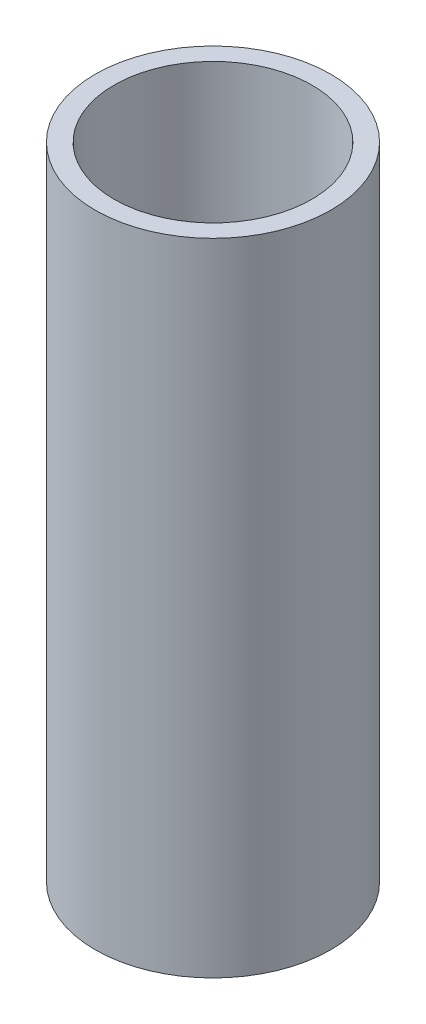
ISO-10303-21;
HEADER;
FILE_DESCRIPTION(('STEP AP214'),'2;1');
FILE_NAME('part.step','',(''),(''),'','','');
FILE_SCHEMA(('AUTOMOTIVE_DESIGN { 1 0 10303 214 1 1 1 1 }'));
ENDSEC;
DATA;
#1=APPLICATION_CONTEXT('core data for automotive mechanical design processes');
#2=APPLICATION_PROTOCOL_DEFINITION('international standard','automotive_design',2000,#1);
#3=PRODUCT_CONTEXT('',#1,'mechanical');
#4=PRODUCT('Part','Part','',(#3));
#5=PRODUCT_RELATED_PRODUCT_CATEGORY('part','',(#4));
#6=PRODUCT_DEFINITION_FORMATION('','',#4);
#7=PRODUCT_DEFINITION_CONTEXT('part definition',#1,'design');
#8=PRODUCT_DEFINITION('design','',#6,#7);
#9=PRODUCT_DEFINITION_SHAPE('','',#8);
#10=(LENGTH_UNIT() NAMED_UNIT(*) SI_UNIT(.MILLI.,.METRE.));
#11=(NAMED_UNIT(*) PLANE_ANGLE_UNIT() SI_UNIT($,.RADIAN.));
#12=(NAMED_UNIT(*) SI_UNIT($,.STERADIAN.) SOLID_ANGLE_UNIT());
#13=UNCERTAINTY_MEASURE_WITH_UNIT(LENGTH_MEASURE(1.E-05),#10,'distance_accuracy_value','');
#14=(GEOMETRIC_REPRESENTATION_CONTEXT(3) GLOBAL_UNCERTAINTY_ASSIGNED_CONTEXT((#13)) GLOBAL_UNIT_ASSIGNED_CONTEXT((#10,
#11,#12)) REPRESENTATION_CONTEXT('',''));
#15=CARTESIAN_POINT('',(0.,0.,0.));
#16=DIRECTION('',(0.,0.,1.));
#17=DIRECTION('',(1.,0.,0.));
#18=AXIS2_PLACEMENT_3D('',#15,#16,#17);
#19=CARTESIAN_POINT('',(0.,27.19,0.));
#20=DIRECTION('',(0.,1.,0.));
#21=DIRECTION('',(0.,0.,1.));
#22=AXIS2_PLACEMENT_3D('',#19,#20,#21);
#23=PLANE('',#22);
#24=CARTESIAN_POINT('',(0.,27.19,0.));
#25=DIRECTION('',(0.,1.,0.));
#26=DIRECTION('',(0.,0.,1.));
#27=AXIS2_PLACEMENT_3D('',#24,#25,#26);
#28=CIRCLE('',#27,5.);
#29=CARTESIAN_POINT('',(0.,27.19,5.));
#30=VERTEX_POINT('',#29);
#31=EDGE_CURVE('E10',#30,#30,#28,.T.);
#32=ORIENTED_EDGE('',*,*,#31,.T.);
#33=EDGE_LOOP('',(#32));
#34=FACE_BOUND('',#33,.T.);
#35=CARTESIAN_POINT('',(0.,27.19,0.));
#36=DIRECTION('',(0.,1.,0.));
#37=DIRECTION('',(0.,0.,1.));
#38=AXIS2_PLACEMENT_3D('',#35,#36,#37);
#39=CIRCLE('',#38,4.2);
#40=CARTESIAN_POINT('',(0.,27.19,4.2));
#41=VERTEX_POINT('',#40);
#42=EDGE_CURVE('E44',#41,#41,#39,.T.);
#43=ORIENTED_EDGE('',*,*,#42,.F.);
#44=EDGE_LOOP('',(#43));
#45=FACE_BOUND('',#44,.T.);
#46=ADVANCED_FACE('F33',(#34,#45),#23,.T.);
#47=CARTESIAN_POINT('',(0.,0.,0.));
#48=DIRECTION('',(0.,1.,0.));
#49=DIRECTION('',(0.,0.,1.));
#50=AXIS2_PLACEMENT_3D('',#47,#48,#49);
#51=PLANE('',#50);
#52=CARTESIAN_POINT('',(0.,0.,0.));
#53=DIRECTION('',(0.,1.,0.));
#54=DIRECTION('',(0.,0.,1.));
#55=AXIS2_PLACEMENT_3D('',#52,#53,#54);
#56=CIRCLE('',#55,5.);
#57=CARTESIAN_POINT('',(0.,0.,5.));
#58=VERTEX_POINT('',#57);
#59=EDGE_CURVE('E37',#58,#58,#56,.T.);
#60=ORIENTED_EDGE('',*,*,#59,.F.);
#61=EDGE_LOOP('',(#60));
#62=FACE_BOUND('',#61,.T.);
#63=CARTESIAN_POINT('',(0.,0.,0.));
#64=DIRECTION('',(0.,1.,0.));
#65=DIRECTION('',(0.,0.,1.));
#66=AXIS2_PLACEMENT_3D('',#63,#64,#65);
#67=CIRCLE('',#66,4.2);
#68=CARTESIAN_POINT('',(0.,0.,4.2));
#69=VERTEX_POINT('',#68);
#70=EDGE_CURVE('E46',#69,#69,#67,.T.);
#71=ORIENTED_EDGE('',*,*,#70,.T.);
#72=EDGE_LOOP('',(#71));
#73=FACE_BOUND('',#72,.T.);
#74=ADVANCED_FACE('F56',(#62,#73),#51,.F.);
#75=CARTESIAN_POINT('',(0.,27.19,0.));
#76=DIRECTION('',(0.,-1.,0.));
#77=DIRECTION('',(0.,0.,-1.));
#78=AXIS2_PLACEMENT_3D('',#75,#76,#77);
#79=CYLINDRICAL_SURFACE('',#78,5.);
#80=ORIENTED_EDGE('',*,*,#31,.F.);
#81=EDGE_LOOP('',(#80));
#82=FACE_BOUND('',#81,.T.);
#83=ORIENTED_EDGE('',*,*,#59,.T.);
#84=EDGE_LOOP('',(#83));
#85=FACE_BOUND('',#84,.T.);
#86=ADVANCED_FACE('F35',(#82,#85),#79,.T.);
#87=CARTESIAN_POINT('',(0.,27.19,0.));
#88=DIRECTION('',(0.,-1.,0.));
#89=DIRECTION('',(0.,0.,-1.));
#90=AXIS2_PLACEMENT_3D('',#87,#88,#89);
#91=CYLINDRICAL_SURFACE('',#90,4.2);
#92=ORIENTED_EDGE('',*,*,#42,.T.);
#93=EDGE_LOOP('',(#92));
#94=FACE_BOUND('',#93,.T.);
#95=ORIENTED_EDGE('',*,*,#70,.F.);
#96=EDGE_LOOP('',(#95));
#97=FACE_BOUND('',#96,.T.);
#98=ADVANCED_FACE('F52',(#94,#97),#91,.F.);
#99=CLOSED_SHELL('',(#46,#74,#86,#98));
#100=MANIFOLD_SOLID_BREP('B2',#99);
#101=ADVANCED_BREP_SHAPE_REPRESENTATION('',(#18,#100),#14);
#102=SHAPE_DEFINITION_REPRESENTATION(#9,#101);
ENDSEC;
END-ISO-10303-21;
